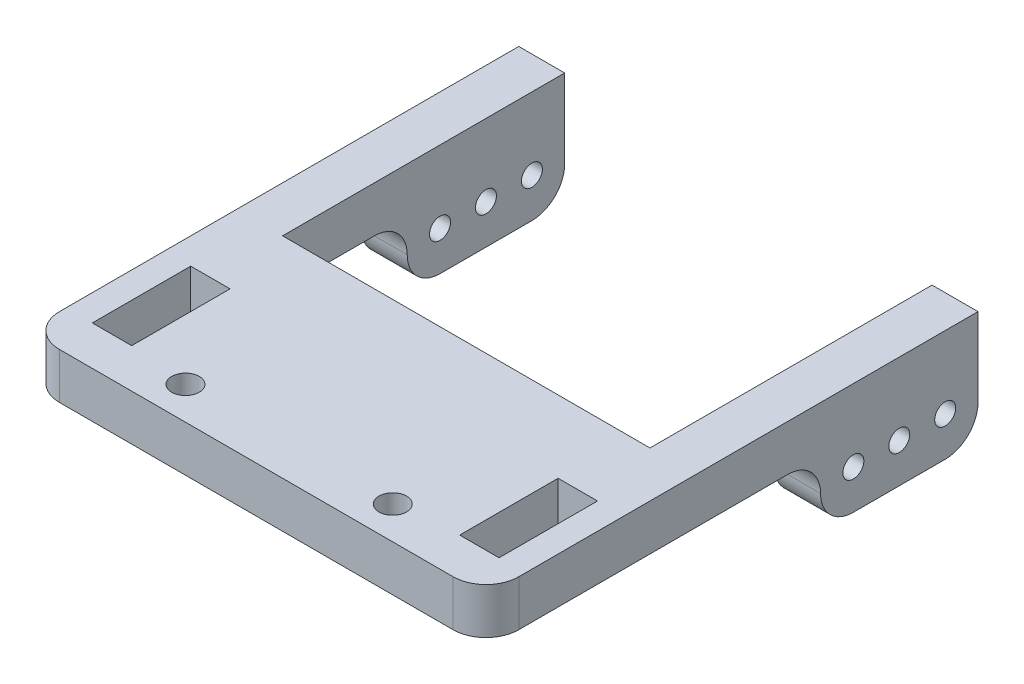
ISO-10303-21;
HEADER;
FILE_DESCRIPTION(('STEP AP214'),'2;1');
FILE_NAME('part.step','',(''),(''),'','','');
FILE_SCHEMA(('AUTOMOTIVE_DESIGN { 1 0 10303 214 1 1 1 1 }'));
ENDSEC;
DATA;
#1=APPLICATION_CONTEXT('core data for automotive mechanical design processes');
#2=APPLICATION_PROTOCOL_DEFINITION('international standard','automotive_design',2000,#1);
#3=PRODUCT_CONTEXT('',#1,'mechanical');
#4=PRODUCT('Part','Part','',(#3));
#5=PRODUCT_RELATED_PRODUCT_CATEGORY('part','',(#4));
#6=PRODUCT_DEFINITION_FORMATION('','',#4);
#7=PRODUCT_DEFINITION_CONTEXT('part definition',#1,'design');
#8=PRODUCT_DEFINITION('design','',#6,#7);
#9=PRODUCT_DEFINITION_SHAPE('','',#8);
#10=(LENGTH_UNIT() NAMED_UNIT(*) SI_UNIT(.MILLI.,.METRE.));
#11=(NAMED_UNIT(*) PLANE_ANGLE_UNIT() SI_UNIT($,.RADIAN.));
#12=(NAMED_UNIT(*) SI_UNIT($,.STERADIAN.) SOLID_ANGLE_UNIT());
#13=UNCERTAINTY_MEASURE_WITH_UNIT(LENGTH_MEASURE(1.E-05),#10,'distance_accuracy_value','');
#14=(GEOMETRIC_REPRESENTATION_CONTEXT(3) GLOBAL_UNCERTAINTY_ASSIGNED_CONTEXT((#13)) GLOBAL_UNIT_ASSIGNED_CONTEXT((#10,
#11,#12)) REPRESENTATION_CONTEXT('',''));
#15=CARTESIAN_POINT('',(0.,0.,0.));
#16=DIRECTION('',(0.,0.,1.));
#17=DIRECTION('',(1.,0.,0.));
#18=AXIS2_PLACEMENT_3D('',#15,#16,#17);
#19=CARTESIAN_POINT('',(0.,0.,0.));
#20=DIRECTION('',(0.,1.,0.));
#21=DIRECTION('',(0.,0.,1.));
#22=AXIS2_PLACEMENT_3D('',#19,#20,#21);
#23=PLANE('',#22);
#24=CARTESIAN_POINT('',(19.2,0.,70.));
#25=DIRECTION('',(0.,1.,0.));
#26=DIRECTION('',(0.,0.,1.));
#27=AXIS2_PLACEMENT_3D('',#24,#25,#26);
#28=CIRCLE('',#27,2.1);
#29=CARTESIAN_POINT('',(19.2,0.,72.1));
#30=VERTEX_POINT('',#29);
#31=EDGE_CURVE('E568',#30,#30,#28,.F.);
#32=ORIENTED_EDGE('',*,*,#31,.F.);
#33=EDGE_LOOP('',(#32));
#34=FACE_BOUND('',#33,.T.);
#35=CARTESIAN_POINT('',(50.8,0.,70.));
#36=DIRECTION('',(0.,1.,0.));
#37=DIRECTION('',(0.,0.,1.));
#38=AXIS2_PLACEMENT_3D('',#35,#36,#37);
#39=CIRCLE('',#38,2.1);
#40=CARTESIAN_POINT('',(50.8,0.,72.1));
#41=VERTEX_POINT('',#40);
#42=EDGE_CURVE('E409',#41,#41,#39,.F.);
#43=ORIENTED_EDGE('',*,*,#42,.F.);
#44=EDGE_LOOP('',(#43));
#45=FACE_BOUND('',#44,.T.);
#46=DIRECTION('',(0.,0.,-1.));
#47=VECTOR('',#46,1.);
#48=CARTESIAN_POINT('',(66.,0.,54.));
#49=LINE('',#48,#47);
#50=CARTESIAN_POINT('',(66.,0.,69.));
#51=VERTEX_POINT('',#50);
#52=CARTESIAN_POINT('',(66.,0.,54.));
#53=VERTEX_POINT('',#52);
#54=EDGE_CURVE('E226',#51,#53,#49,.T.);
#55=ORIENTED_EDGE('',*,*,#54,.T.);
#56=DIRECTION('',(-1.,0.,0.));
#57=VECTOR('',#56,1.);
#58=CARTESIAN_POINT('',(60.,0.,54.));
#59=LINE('',#58,#57);
#60=CARTESIAN_POINT('',(60.,0.,54.));
#61=VERTEX_POINT('',#60);
#62=EDGE_CURVE('E265',#53,#61,#59,.T.);
#63=ORIENTED_EDGE('',*,*,#62,.T.);
#64=DIRECTION('',(0.,0.,1.));
#65=VECTOR('',#64,1.);
#66=CARTESIAN_POINT('',(60.,0.,54.));
#67=LINE('',#66,#65);
#68=CARTESIAN_POINT('',(60.,0.,69.));
#69=VERTEX_POINT('',#68);
#70=EDGE_CURVE('E268',#61,#69,#67,.T.);
#71=ORIENTED_EDGE('',*,*,#70,.T.);
#72=DIRECTION('',(1.,0.,0.));
#73=VECTOR('',#72,1.);
#74=CARTESIAN_POINT('',(60.,0.,69.));
#75=LINE('',#74,#73);
#76=EDGE_CURVE('E255',#69,#51,#75,.T.);
#77=ORIENTED_EDGE('',*,*,#76,.T.);
#78=EDGE_LOOP('',(#55,#63,#71,#77));
#79=FACE_BOUND('',#78,.T.);
#80=DIRECTION('',(0.,0.,-1.));
#81=VECTOR('',#80,1.);
#82=CARTESIAN_POINT('',(10.,0.,54.0000000000002));
#83=LINE('',#82,#81);
#84=CARTESIAN_POINT('',(10.0000000000002,0.,69.0000000000002));
#85=VERTEX_POINT('',#84);
#86=CARTESIAN_POINT('',(10.,0.,54.0000000000002));
#87=VERTEX_POINT('',#86);
#88=EDGE_CURVE('E239',#85,#87,#83,.T.);
#89=ORIENTED_EDGE('',*,*,#88,.T.);
#90=DIRECTION('',(-1.,0.,0.));
#91=VECTOR('',#90,1.);
#92=CARTESIAN_POINT('',(10.,0.,54.0000000000002));
#93=LINE('',#92,#91);
#94=CARTESIAN_POINT('',(4.00000000000007,0.,54.0000000000002));
#95=VERTEX_POINT('',#94);
#96=EDGE_CURVE('E225',#87,#95,#93,.T.);
#97=ORIENTED_EDGE('',*,*,#96,.T.);
#98=DIRECTION('',(0.,0.,1.));
#99=VECTOR('',#98,1.);
#100=CARTESIAN_POINT('',(4.00000000000007,0.,54.0000000000002));
#101=LINE('',#100,#99);
#102=CARTESIAN_POINT('',(4.00000000000018,0.,69.0000000000002));
#103=VERTEX_POINT('',#102);
#104=EDGE_CURVE('E243',#95,#103,#101,.T.);
#105=ORIENTED_EDGE('',*,*,#104,.T.);
#106=DIRECTION('',(1.,0.,0.));
#107=VECTOR('',#106,1.);
#108=CARTESIAN_POINT('',(10.0000000000002,0.,69.0000000000002));
#109=LINE('',#108,#107);
#110=EDGE_CURVE('E219',#103,#85,#109,.T.);
#111=ORIENTED_EDGE('',*,*,#110,.T.);
#112=EDGE_LOOP('',(#89,#97,#105,#111));
#113=FACE_BOUND('',#112,.T.);
#114=DIRECTION('',(0.,0.,-1.));
#115=VECTOR('',#114,1.);
#116=CARTESIAN_POINT('',(70.,0.,0.));
#117=LINE('',#116,#115);
#118=CARTESIAN_POINT('',(70.,0.,70.));
#119=VERTEX_POINT('',#118);
#120=CARTESIAN_POINT('',(70.,0.,29.));
#121=VERTEX_POINT('',#120);
#122=EDGE_CURVE('E308',#119,#121,#117,.T.);
#123=ORIENTED_EDGE('',*,*,#122,.F.);
#124=CARTESIAN_POINT('',(65.,0.,70.));
#125=DIRECTION('',(0.,1.,0.));
#126=DIRECTION('',(0.,0.,1.));
#127=AXIS2_PLACEMENT_3D('',#124,#125,#126);
#128=CIRCLE('',#127,5.);
#129=CARTESIAN_POINT('',(65.,0.,75.));
#130=VERTEX_POINT('',#129);
#131=EDGE_CURVE('E358',#119,#130,#128,.F.);
#132=ORIENTED_EDGE('',*,*,#131,.T.);
#133=DIRECTION('',(1.,0.,0.));
#134=VECTOR('',#133,1.);
#135=CARTESIAN_POINT('',(0.,0.,75.));
#136=LINE('',#135,#134);
#137=CARTESIAN_POINT('',(5.,0.,75.));
#138=VERTEX_POINT('',#137);
#139=EDGE_CURVE('E305',#138,#130,#136,.T.);
#140=ORIENTED_EDGE('',*,*,#139,.F.);
#141=CARTESIAN_POINT('',(5.,0.,70.));
#142=DIRECTION('',(0.,1.,0.));
#143=DIRECTION('',(0.,0.,1.));
#144=AXIS2_PLACEMENT_3D('',#141,#142,#143);
#145=CIRCLE('',#144,5.);
#146=CARTESIAN_POINT('',(0.,0.,70.));
#147=VERTEX_POINT('',#146);
#148=EDGE_CURVE('E356',#138,#147,#145,.F.);
#149=ORIENTED_EDGE('',*,*,#148,.T.);
#150=DIRECTION('',(0.,0.,1.));
#151=VECTOR('',#150,1.);
#152=CARTESIAN_POINT('',(0.,0.,0.));
#153=LINE('',#152,#151);
#154=CARTESIAN_POINT('',(0.,0.,29.));
#155=VERTEX_POINT('',#154);
#156=EDGE_CURVE('E282',#155,#147,#153,.T.);
#157=ORIENTED_EDGE('',*,*,#156,.F.);
#158=DIRECTION('',(-1.,0.,0.));
#159=VECTOR('',#158,1.);
#160=CARTESIAN_POINT('',(7.,0.,29.));
#161=LINE('',#160,#159);
#162=CARTESIAN_POINT('',(7.,0.,29.));
#163=VERTEX_POINT('',#162);
#164=EDGE_CURVE('E352',#155,#163,#161,.F.);
#165=ORIENTED_EDGE('',*,*,#164,.T.);
#166=DIRECTION('',(0.,0.,-1.));
#167=VECTOR('',#166,1.);
#168=CARTESIAN_POINT('',(7.,0.,43.));
#169=LINE('',#168,#167);
#170=CARTESIAN_POINT('',(7.,0.,43.));
#171=VERTEX_POINT('',#170);
#172=EDGE_CURVE('E287',#171,#163,#169,.T.);
#173=ORIENTED_EDGE('',*,*,#172,.F.);
#174=DIRECTION('',(-1.,0.,0.));
#175=VECTOR('',#174,1.);
#176=CARTESIAN_POINT('',(7.,0.,43.));
#177=LINE('',#176,#175);
#178=CARTESIAN_POINT('',(63.,0.,43.));
#179=VERTEX_POINT('',#178);
#180=EDGE_CURVE('E313',#179,#171,#177,.T.);
#181=ORIENTED_EDGE('',*,*,#180,.F.);
#182=DIRECTION('',(0.,0.,1.));
#183=VECTOR('',#182,1.);
#184=CARTESIAN_POINT('',(63.,0.,43.));
#185=LINE('',#184,#183);
#186=CARTESIAN_POINT('',(63.,0.,29.));
#187=VERTEX_POINT('',#186);
#188=EDGE_CURVE('E311',#187,#179,#185,.T.);
#189=ORIENTED_EDGE('',*,*,#188,.F.);
#190=DIRECTION('',(-1.,0.,0.));
#191=VECTOR('',#190,1.);
#192=CARTESIAN_POINT('',(70.,0.,29.));
#193=LINE('',#192,#191);
#194=EDGE_CURVE('E354',#187,#121,#193,.F.);
#195=ORIENTED_EDGE('',*,*,#194,.T.);
#196=EDGE_LOOP('',(#123,#132,#140,#149,#157,#165,#173,#181,#189,#195));
#197=FACE_BOUND('',#196,.T.);
#198=ADVANCED_FACE('F33',(#34,#45,#79,#113,#197),#23,.F.);
#199=CARTESIAN_POINT('',(0.,7.,0.));
#200=DIRECTION('',(0.,1.,0.));
#201=DIRECTION('',(0.,0.,1.));
#202=AXIS2_PLACEMENT_3D('',#199,#200,#201);
#203=PLANE('',#202);
#204=CARTESIAN_POINT('',(19.2,7.,70.));
#205=DIRECTION('',(0.,1.,0.));
#206=DIRECTION('',(0.,0.,1.));
#207=AXIS2_PLACEMENT_3D('',#204,#205,#206);
#208=CIRCLE('',#207,2.1);
#209=CARTESIAN_POINT('',(19.2,7.,72.1));
#210=VERTEX_POINT('',#209);
#211=EDGE_CURVE('E566',#210,#210,#208,.T.);
#212=ORIENTED_EDGE('',*,*,#211,.F.);
#213=EDGE_LOOP('',(#212));
#214=FACE_BOUND('',#213,.T.);
#215=CARTESIAN_POINT('',(50.8,7.,70.));
#216=DIRECTION('',(0.,1.,0.));
#217=DIRECTION('',(0.,0.,-1.));
#218=AXIS2_PLACEMENT_3D('',#215,#216,#217);
#219=CIRCLE('',#218,2.1);
#220=CARTESIAN_POINT('',(50.8,7.,67.9));
#221=VERTEX_POINT('',#220);
#222=EDGE_CURVE('E404',#221,#221,#219,.T.);
#223=ORIENTED_EDGE('',*,*,#222,.F.);
#224=EDGE_LOOP('',(#223));
#225=FACE_BOUND('',#224,.T.);
#226=DIRECTION('',(1.,0.,0.));
#227=VECTOR('',#226,1.);
#228=CARTESIAN_POINT('',(0.,7.,75.));
#229=LINE('',#228,#227);
#230=CARTESIAN_POINT('',(5.,7.,75.));
#231=VERTEX_POINT('',#230);
#232=CARTESIAN_POINT('',(65.,7.,75.));
#233=VERTEX_POINT('',#232);
#234=EDGE_CURVE('E286',#231,#233,#229,.T.);
#235=ORIENTED_EDGE('',*,*,#234,.T.);
#236=CARTESIAN_POINT('',(65.,7.,70.));
#237=DIRECTION('',(0.,1.,0.));
#238=DIRECTION('',(0.,0.,1.));
#239=AXIS2_PLACEMENT_3D('',#236,#237,#238);
#240=CIRCLE('',#239,5.);
#241=CARTESIAN_POINT('',(70.,7.,70.));
#242=VERTEX_POINT('',#241);
#243=EDGE_CURVE('E367',#233,#242,#240,.T.);
#244=ORIENTED_EDGE('',*,*,#243,.T.);
#245=DIRECTION('',(0.,0.,-1.));
#246=VECTOR('',#245,1.);
#247=CARTESIAN_POINT('',(70.,7.,0.));
#248=LINE('',#247,#246);
#249=CARTESIAN_POINT('',(70.,7.,0.));
#250=VERTEX_POINT('',#249);
#251=EDGE_CURVE('E290',#242,#250,#248,.T.);
#252=ORIENTED_EDGE('',*,*,#251,.T.);
#253=DIRECTION('',(-1.,0.,0.));
#254=VECTOR('',#253,1.);
#255=CARTESIAN_POINT('',(63.,7.,0.));
#256=LINE('',#255,#254);
#257=CARTESIAN_POINT('',(63.,7.,0.));
#258=VERTEX_POINT('',#257);
#259=EDGE_CURVE('E292',#250,#258,#256,.T.);
#260=ORIENTED_EDGE('',*,*,#259,.T.);
#261=DIRECTION('',(0.,0.,1.));
#262=VECTOR('',#261,1.);
#263=CARTESIAN_POINT('',(63.,7.,43.));
#264=LINE('',#263,#262);
#265=CARTESIAN_POINT('',(63.,7.,43.));
#266=VERTEX_POINT('',#265);
#267=EDGE_CURVE('E294',#258,#266,#264,.T.);
#268=ORIENTED_EDGE('',*,*,#267,.T.);
#269=DIRECTION('',(-1.,0.,0.));
#270=VECTOR('',#269,1.);
#271=CARTESIAN_POINT('',(7.,7.,43.));
#272=LINE('',#271,#270);
#273=CARTESIAN_POINT('',(7.,7.,43.));
#274=VERTEX_POINT('',#273);
#275=EDGE_CURVE('E296',#266,#274,#272,.T.);
#276=ORIENTED_EDGE('',*,*,#275,.T.);
#277=DIRECTION('',(0.,0.,-1.));
#278=VECTOR('',#277,1.);
#279=CARTESIAN_POINT('',(7.,7.,43.));
#280=LINE('',#279,#278);
#281=CARTESIAN_POINT('',(7.,7.,0.));
#282=VERTEX_POINT('',#281);
#283=EDGE_CURVE('E298',#274,#282,#280,.T.);
#284=ORIENTED_EDGE('',*,*,#283,.T.);
#285=DIRECTION('',(-1.,0.,0.));
#286=VECTOR('',#285,1.);
#287=CARTESIAN_POINT('',(0.,7.,0.));
#288=LINE('',#287,#286);
#289=CARTESIAN_POINT('',(0.,7.,0.));
#290=VERTEX_POINT('',#289);
#291=EDGE_CURVE('E300',#282,#290,#288,.T.);
#292=ORIENTED_EDGE('',*,*,#291,.T.);
#293=DIRECTION('',(0.,0.,1.));
#294=VECTOR('',#293,1.);
#295=CARTESIAN_POINT('',(0.,7.,0.));
#296=LINE('',#295,#294);
#297=CARTESIAN_POINT('',(0.,7.,70.));
#298=VERTEX_POINT('',#297);
#299=EDGE_CURVE('E283',#290,#298,#296,.T.);
#300=ORIENTED_EDGE('',*,*,#299,.T.);
#301=CARTESIAN_POINT('',(5.,7.,70.));
#302=DIRECTION('',(0.,1.,0.));
#303=DIRECTION('',(0.,0.,1.));
#304=AXIS2_PLACEMENT_3D('',#301,#302,#303);
#305=CIRCLE('',#304,5.);
#306=EDGE_CURVE('E365',#298,#231,#305,.T.);
#307=ORIENTED_EDGE('',*,*,#306,.T.);
#308=EDGE_LOOP('',(#235,#244,#252,#260,#268,#276,#284,#292,#300,#307));
#309=FACE_BOUND('',#308,.T.);
#310=DIRECTION('',(-1.,0.,0.));
#311=VECTOR('',#310,1.);
#312=CARTESIAN_POINT('',(60.,7.,54.));
#313=LINE('',#312,#311);
#314=CARTESIAN_POINT('',(66.,7.,54.));
#315=VERTEX_POINT('',#314);
#316=CARTESIAN_POINT('',(60.,7.,54.));
#317=VERTEX_POINT('',#316);
#318=EDGE_CURVE('E254',#315,#317,#313,.T.);
#319=ORIENTED_EDGE('',*,*,#318,.F.);
#320=DIRECTION('',(0.,0.,-1.));
#321=VECTOR('',#320,1.);
#322=CARTESIAN_POINT('',(66.,7.,54.));
#323=LINE('',#322,#321);
#324=CARTESIAN_POINT('',(66.,7.,69.));
#325=VERTEX_POINT('',#324);
#326=EDGE_CURVE('E252',#325,#315,#323,.T.);
#327=ORIENTED_EDGE('',*,*,#326,.F.);
#328=DIRECTION('',(1.,0.,0.));
#329=VECTOR('',#328,1.);
#330=CARTESIAN_POINT('',(60.,7.,69.));
#331=LINE('',#330,#329);
#332=CARTESIAN_POINT('',(60.,7.,69.));
#333=VERTEX_POINT('',#332);
#334=EDGE_CURVE('E260',#333,#325,#331,.T.);
#335=ORIENTED_EDGE('',*,*,#334,.F.);
#336=DIRECTION('',(0.,0.,1.));
#337=VECTOR('',#336,1.);
#338=CARTESIAN_POINT('',(60.,7.,54.));
#339=LINE('',#338,#337);
#340=EDGE_CURVE('E257',#317,#333,#339,.T.);
#341=ORIENTED_EDGE('',*,*,#340,.F.);
#342=EDGE_LOOP('',(#319,#327,#335,#341));
#343=FACE_BOUND('',#342,.T.);
#344=DIRECTION('',(-1.,0.,0.));
#345=VECTOR('',#344,1.);
#346=CARTESIAN_POINT('',(10.,7.,54.0000000000002));
#347=LINE('',#346,#345);
#348=CARTESIAN_POINT('',(10.,7.,54.0000000000002));
#349=VERTEX_POINT('',#348);
#350=CARTESIAN_POINT('',(4.00000000000007,7.,54.0000000000002));
#351=VERTEX_POINT('',#350);
#352=EDGE_CURVE('E218',#349,#351,#347,.T.);
#353=ORIENTED_EDGE('',*,*,#352,.F.);
#354=DIRECTION('',(0.,0.,-1.));
#355=VECTOR('',#354,1.);
#356=CARTESIAN_POINT('',(10.,7.,54.0000000000002));
#357=LINE('',#356,#355);
#358=CARTESIAN_POINT('',(10.0000000000002,7.,69.0000000000002));
#359=VERTEX_POINT('',#358);
#360=EDGE_CURVE('E208',#359,#349,#357,.T.);
#361=ORIENTED_EDGE('',*,*,#360,.F.);
#362=DIRECTION('',(1.,0.,0.));
#363=VECTOR('',#362,1.);
#364=CARTESIAN_POINT('',(10.0000000000002,7.,69.0000000000002));
#365=LINE('',#364,#363);
#366=CARTESIAN_POINT('',(4.00000000000018,7.,69.0000000000002));
#367=VERTEX_POINT('',#366);
#368=EDGE_CURVE('E234',#367,#359,#365,.T.);
#369=ORIENTED_EDGE('',*,*,#368,.F.);
#370=DIRECTION('',(0.,0.,1.));
#371=VECTOR('',#370,1.);
#372=CARTESIAN_POINT('',(4.00000000000007,7.,54.0000000000002));
#373=LINE('',#372,#371);
#374=EDGE_CURVE('E232',#351,#367,#373,.T.);
#375=ORIENTED_EDGE('',*,*,#374,.F.);
#376=EDGE_LOOP('',(#353,#361,#369,#375));
#377=FACE_BOUND('',#376,.T.);
#378=ADVANCED_FACE('F230',(#214,#225,#309,#343,#377),#203,.T.);
#379=CARTESIAN_POINT('',(0.,7.,0.));
#380=DIRECTION('',(1.,0.,0.));
#381=DIRECTION('',(0.,0.,-1.));
#382=AXIS2_PLACEMENT_3D('',#379,#380,#381);
#383=PLANE('',#382);
#384=CARTESIAN_POINT('',(0.,-4.,19.));
#385=DIRECTION('',(1.,0.,0.));
#386=DIRECTION('',(0.,0.,-1.));
#387=AXIS2_PLACEMENT_3D('',#384,#385,#386);
#388=CIRCLE('',#387,1.6);
#389=CARTESIAN_POINT('',(0.,-4.,17.4));
#390=VERTEX_POINT('',#389);
#391=EDGE_CURVE('E337',#390,#390,#388,.T.);
#392=ORIENTED_EDGE('',*,*,#391,.T.);
#393=EDGE_LOOP('',(#392));
#394=FACE_BOUND('',#393,.T.);
#395=CARTESIAN_POINT('',(0.,-4.,5.));
#396=DIRECTION('',(1.,0.,0.));
#397=DIRECTION('',(0.,0.,-1.));
#398=AXIS2_PLACEMENT_3D('',#395,#396,#397);
#399=CIRCLE('',#398,1.6);
#400=CARTESIAN_POINT('',(0.,-4.,3.4));
#401=VERTEX_POINT('',#400);
#402=EDGE_CURVE('E583',#401,#401,#399,.T.);
#403=ORIENTED_EDGE('',*,*,#402,.T.);
#404=EDGE_LOOP('',(#403));
#405=FACE_BOUND('',#404,.T.);
#406=CARTESIAN_POINT('',(0.,-4.,12.));
#407=DIRECTION('',(1.,0.,0.));
#408=DIRECTION('',(0.,0.,-1.));
#409=AXIS2_PLACEMENT_3D('',#406,#407,#408);
#410=CIRCLE('',#409,1.6);
#411=CARTESIAN_POINT('',(0.,-4.,10.4));
#412=VERTEX_POINT('',#411);
#413=EDGE_CURVE('E572',#412,#412,#410,.T.);
#414=ORIENTED_EDGE('',*,*,#413,.T.);
#415=EDGE_LOOP('',(#414));
#416=FACE_BOUND('',#415,.T.);
#417=ORIENTED_EDGE('',*,*,#156,.T.);
#418=DIRECTION('',(0.,-1.,0.));
#419=VECTOR('',#418,1.);
#420=CARTESIAN_POINT('',(0.,7.,70.));
#421=LINE('',#420,#419);
#422=EDGE_CURVE('E373',#147,#298,#421,.F.);
#423=ORIENTED_EDGE('',*,*,#422,.T.);
#424=ORIENTED_EDGE('',*,*,#299,.F.);
#425=DIRECTION('',(0.,-1.,0.));
#426=VECTOR('',#425,1.);
#427=CARTESIAN_POINT('',(0.,7.,0.));
#428=LINE('',#427,#426);
#429=CARTESIAN_POINT('',(0.,-5.,0.));
#430=VERTEX_POINT('',#429);
#431=EDGE_CURVE('E302',#290,#430,#428,.T.);
#432=ORIENTED_EDGE('',*,*,#431,.T.);
#433=CARTESIAN_POINT('',(0.,-5.,5.));
#434=DIRECTION('',(1.,0.,0.));
#435=DIRECTION('',(0.,0.,-1.));
#436=AXIS2_PLACEMENT_3D('',#433,#434,#435);
#437=CIRCLE('',#436,5.);
#438=CARTESIAN_POINT('',(0.,-10.,5.));
#439=VERTEX_POINT('',#438);
#440=EDGE_CURVE('E371',#430,#439,#437,.F.);
#441=ORIENTED_EDGE('',*,*,#440,.T.);
#442=DIRECTION('',(0.,0.,-1.));
#443=VECTOR('',#442,1.);
#444=CARTESIAN_POINT('',(0.,-10.,0.));
#445=LINE('',#444,#443);
#446=CARTESIAN_POINT('',(0.,-10.,19.));
#447=VERTEX_POINT('',#446);
#448=EDGE_CURVE('E462',#447,#439,#445,.T.);
#449=ORIENTED_EDGE('',*,*,#448,.F.);
#450=CARTESIAN_POINT('',(0.,-5.,19.));
#451=DIRECTION('',(1.,0.,0.));
#452=DIRECTION('',(0.,0.,-1.));
#453=AXIS2_PLACEMENT_3D('',#450,#451,#452);
#454=CIRCLE('',#453,5.);
#455=CARTESIAN_POINT('',(0.,-5.,24.));
#456=VERTEX_POINT('',#455);
#457=EDGE_CURVE('E369',#447,#456,#454,.F.);
#458=ORIENTED_EDGE('',*,*,#457,.T.);
#459=CARTESIAN_POINT('',(0.,-5.,29.));
#460=DIRECTION('',(1.,0.,0.));
#461=DIRECTION('',(0.,0.,-1.));
#462=AXIS2_PLACEMENT_3D('',#459,#460,#461);
#463=CIRCLE('',#462,5.);
#464=EDGE_CURVE('E42',#456,#155,#463,.T.);
#465=ORIENTED_EDGE('',*,*,#464,.T.);
#466=EDGE_LOOP('',(#417,#423,#424,#432,#441,#449,#458,#465));
#467=FACE_BOUND('',#466,.T.);
#468=ADVANCED_FACE('F421',(#394,#405,#416,#467),#383,.F.);
#469=CARTESIAN_POINT('',(0.,7.,75.));
#470=DIRECTION('',(0.,0.,-1.));
#471=DIRECTION('',(-1.,0.,0.));
#472=AXIS2_PLACEMENT_3D('',#469,#470,#471);
#473=PLANE('',#472);
#474=ORIENTED_EDGE('',*,*,#139,.T.);
#475=DIRECTION('',(0.,-1.,0.));
#476=VECTOR('',#475,1.);
#477=CARTESIAN_POINT('',(65.,7.,75.));
#478=LINE('',#477,#476);
#479=EDGE_CURVE('E363',#130,#233,#478,.F.);
#480=ORIENTED_EDGE('',*,*,#479,.T.);
#481=ORIENTED_EDGE('',*,*,#234,.F.);
#482=DIRECTION('',(0.,-1.,0.));
#483=VECTOR('',#482,1.);
#484=CARTESIAN_POINT('',(5.,7.,75.));
#485=LINE('',#484,#483);
#486=EDGE_CURVE('E360',#231,#138,#485,.T.);
#487=ORIENTED_EDGE('',*,*,#486,.T.);
#488=EDGE_LOOP('',(#474,#480,#481,#487));
#489=FACE_BOUND('',#488,.T.);
#490=ADVANCED_FACE('F434',(#489),#473,.F.);
#491=CARTESIAN_POINT('',(70.,7.,0.));
#492=DIRECTION('',(-1.,0.,0.));
#493=DIRECTION('',(0.,0.,1.));
#494=AXIS2_PLACEMENT_3D('',#491,#492,#493);
#495=PLANE('',#494);
#496=CARTESIAN_POINT('',(70.,-4.,19.));
#497=DIRECTION('',(1.,0.,0.));
#498=DIRECTION('',(0.,0.,-1.));
#499=AXIS2_PLACEMENT_3D('',#496,#497,#498);
#500=CIRCLE('',#499,1.6);
#501=CARTESIAN_POINT('',(70.,-4.,17.4));
#502=VERTEX_POINT('',#501);
#503=EDGE_CURVE('E580',#502,#502,#500,.T.);
#504=ORIENTED_EDGE('',*,*,#503,.F.);
#505=EDGE_LOOP('',(#504));
#506=FACE_BOUND('',#505,.T.);
#507=CARTESIAN_POINT('',(70.,-4.,5.));
#508=DIRECTION('',(1.,0.,0.));
#509=DIRECTION('',(0.,0.,-1.));
#510=AXIS2_PLACEMENT_3D('',#507,#508,#509);
#511=CIRCLE('',#510,1.6);
#512=CARTESIAN_POINT('',(70.,-4.,3.4));
#513=VERTEX_POINT('',#512);
#514=EDGE_CURVE('E586',#513,#513,#511,.T.);
#515=ORIENTED_EDGE('',*,*,#514,.F.);
#516=EDGE_LOOP('',(#515));
#517=FACE_BOUND('',#516,.T.);
#518=CARTESIAN_POINT('',(70.,-4.,12.));
#519=DIRECTION('',(1.,0.,0.));
#520=DIRECTION('',(0.,0.,-1.));
#521=AXIS2_PLACEMENT_3D('',#518,#519,#520);
#522=CIRCLE('',#521,1.6);
#523=CARTESIAN_POINT('',(70.,-4.,10.4));
#524=VERTEX_POINT('',#523);
#525=EDGE_CURVE('E569',#524,#524,#522,.T.);
#526=ORIENTED_EDGE('',*,*,#525,.F.);
#527=EDGE_LOOP('',(#526));
#528=FACE_BOUND('',#527,.T.);
#529=ORIENTED_EDGE('',*,*,#251,.F.);
#530=DIRECTION('',(0.,-1.,0.));
#531=VECTOR('',#530,1.);
#532=CARTESIAN_POINT('',(70.,7.,70.));
#533=LINE('',#532,#531);
#534=EDGE_CURVE('E349',#242,#119,#533,.T.);
#535=ORIENTED_EDGE('',*,*,#534,.T.);
#536=ORIENTED_EDGE('',*,*,#122,.T.);
#537=CARTESIAN_POINT('',(70.,-5.,29.));
#538=DIRECTION('',(-1.,0.,0.));
#539=DIRECTION('',(0.,0.,1.));
#540=AXIS2_PLACEMENT_3D('',#537,#538,#539);
#541=CIRCLE('',#540,5.);
#542=CARTESIAN_POINT('',(70.,-5.,24.));
#543=VERTEX_POINT('',#542);
#544=EDGE_CURVE('E400',#121,#543,#541,.T.);
#545=ORIENTED_EDGE('',*,*,#544,.T.);
#546=CARTESIAN_POINT('',(70.,-5.,19.));
#547=DIRECTION('',(-1.,0.,0.));
#548=DIRECTION('',(0.,0.,1.));
#549=AXIS2_PLACEMENT_3D('',#546,#547,#548);
#550=CIRCLE('',#549,5.);
#551=CARTESIAN_POINT('',(70.,-10.,19.));
#552=VERTEX_POINT('',#551);
#553=EDGE_CURVE('E347',#543,#552,#550,.F.);
#554=ORIENTED_EDGE('',*,*,#553,.T.);
#555=DIRECTION('',(0.,0.,1.));
#556=VECTOR('',#555,1.);
#557=CARTESIAN_POINT('',(70.,-10.,0.));
#558=LINE('',#557,#556);
#559=CARTESIAN_POINT('',(70.,-10.,5.));
#560=VERTEX_POINT('',#559);
#561=EDGE_CURVE('E455',#560,#552,#558,.T.);
#562=ORIENTED_EDGE('',*,*,#561,.F.);
#563=CARTESIAN_POINT('',(70.,-5.,5.));
#564=DIRECTION('',(-1.,0.,0.));
#565=DIRECTION('',(0.,0.,1.));
#566=AXIS2_PLACEMENT_3D('',#563,#564,#565);
#567=CIRCLE('',#566,5.);
#568=CARTESIAN_POINT('',(70.,-5.,0.));
#569=VERTEX_POINT('',#568);
#570=EDGE_CURVE('E332',#560,#569,#567,.F.);
#571=ORIENTED_EDGE('',*,*,#570,.T.);
#572=DIRECTION('',(0.,-1.,0.));
#573=VECTOR('',#572,1.);
#574=CARTESIAN_POINT('',(70.,7.,0.));
#575=LINE('',#574,#573);
#576=EDGE_CURVE('E329',#250,#569,#575,.T.);
#577=ORIENTED_EDGE('',*,*,#576,.F.);
#578=EDGE_LOOP('',(#529,#535,#536,#545,#554,#562,#571,#577));
#579=FACE_BOUND('',#578,.T.);
#580=ADVANCED_FACE('F444',(#506,#517,#528,#579),#495,.F.);
#581=CARTESIAN_POINT('',(63.,7.,0.));
#582=DIRECTION('',(0.,0.,1.));
#583=DIRECTION('',(1.,0.,0.));
#584=AXIS2_PLACEMENT_3D('',#581,#582,#583);
#585=PLANE('',#584);
#586=ORIENTED_EDGE('',*,*,#576,.T.);
#587=DIRECTION('',(1.,0.,0.));
#588=VECTOR('',#587,1.);
#589=CARTESIAN_POINT('',(63.,-5.,0.));
#590=LINE('',#589,#588);
#591=CARTESIAN_POINT('',(63.,-5.,0.));
#592=VERTEX_POINT('',#591);
#593=EDGE_CURVE('E385',#569,#592,#590,.F.);
#594=ORIENTED_EDGE('',*,*,#593,.T.);
#595=DIRECTION('',(0.,-1.,0.));
#596=VECTOR('',#595,1.);
#597=CARTESIAN_POINT('',(63.,7.,0.));
#598=LINE('',#597,#596);
#599=EDGE_CURVE('E326',#258,#592,#598,.T.);
#600=ORIENTED_EDGE('',*,*,#599,.F.);
#601=ORIENTED_EDGE('',*,*,#259,.F.);
#602=EDGE_LOOP('',(#586,#594,#600,#601));
#603=FACE_BOUND('',#602,.T.);
#604=ADVANCED_FACE('F598',(#603),#585,.F.);
#605=CARTESIAN_POINT('',(63.,7.,43.));
#606=DIRECTION('',(1.,0.,0.));
#607=DIRECTION('',(0.,0.,-1.));
#608=AXIS2_PLACEMENT_3D('',#605,#606,#607);
#609=PLANE('',#608);
#610=CARTESIAN_POINT('',(63.,-4.,19.));
#611=DIRECTION('',(1.,0.,0.));
#612=DIRECTION('',(0.,0.,-1.));
#613=AXIS2_PLACEMENT_3D('',#610,#611,#612);
#614=CIRCLE('',#613,1.6);
#615=CARTESIAN_POINT('',(63.,-4.,17.4));
#616=VERTEX_POINT('',#615);
#617=EDGE_CURVE('E345',#616,#616,#614,.T.);
#618=ORIENTED_EDGE('',*,*,#617,.T.);
#619=EDGE_LOOP('',(#618));
#620=FACE_BOUND('',#619,.T.);
#621=CARTESIAN_POINT('',(63.,-4.,5.));
#622=DIRECTION('',(1.,0.,0.));
#623=DIRECTION('',(0.,0.,-1.));
#624=AXIS2_PLACEMENT_3D('',#621,#622,#623);
#625=CIRCLE('',#624,1.6);
#626=CARTESIAN_POINT('',(63.,-4.,3.4));
#627=VERTEX_POINT('',#626);
#628=EDGE_CURVE('E341',#627,#627,#625,.T.);
#629=ORIENTED_EDGE('',*,*,#628,.T.);
#630=EDGE_LOOP('',(#629));
#631=FACE_BOUND('',#630,.T.);
#632=CARTESIAN_POINT('',(63.,-4.,12.));
#633=DIRECTION('',(1.,0.,0.));
#634=DIRECTION('',(0.,0.,-1.));
#635=AXIS2_PLACEMENT_3D('',#632,#633,#634);
#636=CIRCLE('',#635,1.6);
#637=CARTESIAN_POINT('',(63.,-4.,10.4));
#638=VERTEX_POINT('',#637);
#639=EDGE_CURVE('E336',#638,#638,#636,.T.);
#640=ORIENTED_EDGE('',*,*,#639,.T.);
#641=EDGE_LOOP('',(#640));
#642=FACE_BOUND('',#641,.T.);
#643=DIRECTION('',(0.,0.,-1.));
#644=VECTOR('',#643,1.);
#645=CARTESIAN_POINT('',(63.,-10.,0.));
#646=LINE('',#645,#644);
#647=CARTESIAN_POINT('',(63.,-10.,19.));
#648=VERTEX_POINT('',#647);
#649=CARTESIAN_POINT('',(63.,-10.,5.));
#650=VERTEX_POINT('',#649);
#651=EDGE_CURVE('E463',#648,#650,#646,.T.);
#652=ORIENTED_EDGE('',*,*,#651,.F.);
#653=CARTESIAN_POINT('',(63.,-5.,19.));
#654=DIRECTION('',(1.,0.,0.));
#655=DIRECTION('',(0.,0.,-1.));
#656=AXIS2_PLACEMENT_3D('',#653,#654,#655);
#657=CIRCLE('',#656,5.);
#658=CARTESIAN_POINT('',(63.,-5.,24.));
#659=VERTEX_POINT('',#658);
#660=EDGE_CURVE('E383',#648,#659,#657,.F.);
#661=ORIENTED_EDGE('',*,*,#660,.T.);
#662=CARTESIAN_POINT('',(63.,-5.,29.));
#663=DIRECTION('',(1.,0.,0.));
#664=DIRECTION('',(0.,0.,-1.));
#665=AXIS2_PLACEMENT_3D('',#662,#663,#664);
#666=CIRCLE('',#665,5.);
#667=EDGE_CURVE('E398',#659,#187,#666,.T.);
#668=ORIENTED_EDGE('',*,*,#667,.T.);
#669=ORIENTED_EDGE('',*,*,#188,.T.);
#670=DIRECTION('',(0.,-1.,0.));
#671=VECTOR('',#670,1.);
#672=CARTESIAN_POINT('',(63.,7.,43.));
#673=LINE('',#672,#671);
#674=EDGE_CURVE('E323',#266,#179,#673,.T.);
#675=ORIENTED_EDGE('',*,*,#674,.F.);
#676=ORIENTED_EDGE('',*,*,#267,.F.);
#677=ORIENTED_EDGE('',*,*,#599,.T.);
#678=CARTESIAN_POINT('',(63.,-5.,5.));
#679=DIRECTION('',(1.,0.,0.));
#680=DIRECTION('',(0.,0.,-1.));
#681=AXIS2_PLACEMENT_3D('',#678,#679,#680);
#682=CIRCLE('',#681,5.);
#683=EDGE_CURVE('E381',#592,#650,#682,.F.);
#684=ORIENTED_EDGE('',*,*,#683,.T.);
#685=EDGE_LOOP('',(#652,#661,#668,#669,#675,#676,#677,#684));
#686=FACE_BOUND('',#685,.T.);
#687=ADVANCED_FACE('F467',(#620,#631,#642,#686),#609,.F.);
#688=CARTESIAN_POINT('',(7.,7.,43.));
#689=DIRECTION('',(0.,0.,1.));
#690=DIRECTION('',(1.,0.,0.));
#691=AXIS2_PLACEMENT_3D('',#688,#689,#690);
#692=PLANE('',#691);
#693=ORIENTED_EDGE('',*,*,#180,.T.);
#694=DIRECTION('',(0.,-1.,0.));
#695=VECTOR('',#694,1.);
#696=CARTESIAN_POINT('',(7.,7.,43.));
#697=LINE('',#696,#695);
#698=EDGE_CURVE('E320',#274,#171,#697,.T.);
#699=ORIENTED_EDGE('',*,*,#698,.F.);
#700=ORIENTED_EDGE('',*,*,#275,.F.);
#701=ORIENTED_EDGE('',*,*,#674,.T.);
#702=EDGE_LOOP('',(#693,#699,#700,#701));
#703=FACE_BOUND('',#702,.T.);
#704=ADVANCED_FACE('F482',(#703),#692,.F.);
#705=CARTESIAN_POINT('',(7.,7.,43.));
#706=DIRECTION('',(-1.,0.,0.));
#707=DIRECTION('',(0.,0.,1.));
#708=AXIS2_PLACEMENT_3D('',#705,#706,#707);
#709=PLANE('',#708);
#710=CARTESIAN_POINT('',(7.,-4.,19.));
#711=DIRECTION('',(-1.,0.,0.));
#712=DIRECTION('',(0.,0.,1.));
#713=AXIS2_PLACEMENT_3D('',#710,#711,#712);
#714=CIRCLE('',#713,1.6);
#715=CARTESIAN_POINT('',(7.,-4.,20.6));
#716=VERTEX_POINT('',#715);
#717=EDGE_CURVE('E342',#716,#716,#714,.T.);
#718=ORIENTED_EDGE('',*,*,#717,.T.);
#719=EDGE_LOOP('',(#718));
#720=FACE_BOUND('',#719,.T.);
#721=CARTESIAN_POINT('',(7.,-4.,5.));
#722=DIRECTION('',(-1.,0.,0.));
#723=DIRECTION('',(0.,0.,1.));
#724=AXIS2_PLACEMENT_3D('',#721,#722,#723);
#725=CIRCLE('',#724,1.6);
#726=CARTESIAN_POINT('',(7.,-4.,6.6));
#727=VERTEX_POINT('',#726);
#728=EDGE_CURVE('E338',#727,#727,#725,.T.);
#729=ORIENTED_EDGE('',*,*,#728,.T.);
#730=EDGE_LOOP('',(#729));
#731=FACE_BOUND('',#730,.T.);
#732=CARTESIAN_POINT('',(7.,-4.,12.));
#733=DIRECTION('',(-1.,0.,0.));
#734=DIRECTION('',(0.,0.,1.));
#735=AXIS2_PLACEMENT_3D('',#732,#733,#734);
#736=CIRCLE('',#735,1.6);
#737=CARTESIAN_POINT('',(7.,-4.,13.6));
#738=VERTEX_POINT('',#737);
#739=EDGE_CURVE('E333',#738,#738,#736,.T.);
#740=ORIENTED_EDGE('',*,*,#739,.T.);
#741=EDGE_LOOP('',(#740));
#742=FACE_BOUND('',#741,.T.);
#743=DIRECTION('',(0.,0.,1.));
#744=VECTOR('',#743,1.);
#745=CARTESIAN_POINT('',(7.,-10.,0.));
#746=LINE('',#745,#744);
#747=CARTESIAN_POINT('',(7.,-10.,5.));
#748=VERTEX_POINT('',#747);
#749=CARTESIAN_POINT('',(7.,-10.,19.));
#750=VERTEX_POINT('',#749);
#751=EDGE_CURVE('E241',#748,#750,#746,.T.);
#752=ORIENTED_EDGE('',*,*,#751,.F.);
#753=CARTESIAN_POINT('',(7.,-5.,5.));
#754=DIRECTION('',(-1.,0.,0.));
#755=DIRECTION('',(0.,0.,1.));
#756=AXIS2_PLACEMENT_3D('',#753,#754,#755);
#757=CIRCLE('',#756,5.);
#758=CARTESIAN_POINT('',(7.,-5.,0.));
#759=VERTEX_POINT('',#758);
#760=EDGE_CURVE('E50',#748,#759,#757,.F.);
#761=ORIENTED_EDGE('',*,*,#760,.T.);
#762=DIRECTION('',(0.,-1.,0.));
#763=VECTOR('',#762,1.);
#764=CARTESIAN_POINT('',(7.,7.,0.));
#765=LINE('',#764,#763);
#766=EDGE_CURVE('E318',#282,#759,#765,.T.);
#767=ORIENTED_EDGE('',*,*,#766,.F.);
#768=ORIENTED_EDGE('',*,*,#283,.F.);
#769=ORIENTED_EDGE('',*,*,#698,.T.);
#770=ORIENTED_EDGE('',*,*,#172,.T.);
#771=CARTESIAN_POINT('',(7.,-5.,29.));
#772=DIRECTION('',(-1.,0.,0.));
#773=DIRECTION('',(0.,0.,1.));
#774=AXIS2_PLACEMENT_3D('',#771,#772,#773);
#775=CIRCLE('',#774,5.);
#776=CARTESIAN_POINT('',(7.,-5.,24.));
#777=VERTEX_POINT('',#776);
#778=EDGE_CURVE('E11',#163,#777,#775,.T.);
#779=ORIENTED_EDGE('',*,*,#778,.T.);
#780=CARTESIAN_POINT('',(7.,-5.,19.));
#781=DIRECTION('',(-1.,0.,0.));
#782=DIRECTION('',(0.,0.,1.));
#783=AXIS2_PLACEMENT_3D('',#780,#781,#782);
#784=CIRCLE('',#783,5.);
#785=EDGE_CURVE('E393',#777,#750,#784,.F.);
#786=ORIENTED_EDGE('',*,*,#785,.T.);
#787=EDGE_LOOP('',(#752,#761,#767,#768,#769,#770,#779,#786));
#788=FACE_BOUND('',#787,.T.);
#789=ADVANCED_FACE('F479',(#720,#731,#742,#788),#709,.F.);
#790=CARTESIAN_POINT('',(0.,7.,0.));
#791=DIRECTION('',(0.,0.,1.));
#792=DIRECTION('',(1.,0.,0.));
#793=AXIS2_PLACEMENT_3D('',#790,#791,#792);
#794=PLANE('',#793);
#795=ORIENTED_EDGE('',*,*,#766,.T.);
#796=DIRECTION('',(1.,0.,0.));
#797=VECTOR('',#796,1.);
#798=CARTESIAN_POINT('',(0.,-5.,0.));
#799=LINE('',#798,#797);
#800=EDGE_CURVE('E396',#759,#430,#799,.F.);
#801=ORIENTED_EDGE('',*,*,#800,.T.);
#802=ORIENTED_EDGE('',*,*,#431,.F.);
#803=ORIENTED_EDGE('',*,*,#291,.F.);
#804=EDGE_LOOP('',(#795,#801,#802,#803));
#805=FACE_BOUND('',#804,.T.);
#806=ADVANCED_FACE('F481',(#805),#794,.F.);
#807=CARTESIAN_POINT('',(66.,7.,54.));
#808=DIRECTION('',(-1.,0.,0.));
#809=DIRECTION('',(0.,0.,1.));
#810=AXIS2_PLACEMENT_3D('',#807,#808,#809);
#811=PLANE('',#810);
#812=ORIENTED_EDGE('',*,*,#54,.F.);
#813=DIRECTION('',(0.,-1.,0.));
#814=VECTOR('',#813,1.);
#815=CARTESIAN_POINT('',(66.,7.,69.));
#816=LINE('',#815,#814);
#817=EDGE_CURVE('E262',#325,#51,#816,.T.);
#818=ORIENTED_EDGE('',*,*,#817,.F.);
#819=ORIENTED_EDGE('',*,*,#326,.T.);
#820=DIRECTION('',(0.,-1.,0.));
#821=VECTOR('',#820,1.);
#822=CARTESIAN_POINT('',(66.,7.,54.));
#823=LINE('',#822,#821);
#824=EDGE_CURVE('E279',#315,#53,#823,.T.);
#825=ORIENTED_EDGE('',*,*,#824,.T.);
#826=EDGE_LOOP('',(#812,#818,#819,#825));
#827=FACE_BOUND('',#826,.T.);
#828=ADVANCED_FACE('F489',(#827),#811,.T.);
#829=CARTESIAN_POINT('',(60.,7.,54.));
#830=DIRECTION('',(0.,0.,1.));
#831=DIRECTION('',(1.,0.,0.));
#832=AXIS2_PLACEMENT_3D('',#829,#830,#831);
#833=PLANE('',#832);
#834=ORIENTED_EDGE('',*,*,#62,.F.);
#835=ORIENTED_EDGE('',*,*,#824,.F.);
#836=ORIENTED_EDGE('',*,*,#318,.T.);
#837=DIRECTION('',(0.,-1.,0.));
#838=VECTOR('',#837,1.);
#839=CARTESIAN_POINT('',(60.,7.,54.));
#840=LINE('',#839,#838);
#841=EDGE_CURVE('E277',#317,#61,#840,.T.);
#842=ORIENTED_EDGE('',*,*,#841,.T.);
#843=EDGE_LOOP('',(#834,#835,#836,#842));
#844=FACE_BOUND('',#843,.T.);
#845=ADVANCED_FACE('F508',(#844),#833,.T.);
#846=CARTESIAN_POINT('',(60.,7.,54.));
#847=DIRECTION('',(1.,0.,0.));
#848=DIRECTION('',(0.,0.,-1.));
#849=AXIS2_PLACEMENT_3D('',#846,#847,#848);
#850=PLANE('',#849);
#851=ORIENTED_EDGE('',*,*,#70,.F.);
#852=ORIENTED_EDGE('',*,*,#841,.F.);
#853=ORIENTED_EDGE('',*,*,#340,.T.);
#854=DIRECTION('',(0.,-1.,0.));
#855=VECTOR('',#854,1.);
#856=CARTESIAN_POINT('',(60.,7.,69.));
#857=LINE('',#856,#855);
#858=EDGE_CURVE('E275',#333,#69,#857,.T.);
#859=ORIENTED_EDGE('',*,*,#858,.T.);
#860=EDGE_LOOP('',(#851,#852,#853,#859));
#861=FACE_BOUND('',#860,.T.);
#862=ADVANCED_FACE('F512',(#861),#850,.T.);
#863=CARTESIAN_POINT('',(60.,7.,69.));
#864=DIRECTION('',(0.,0.,-1.));
#865=DIRECTION('',(-1.,0.,0.));
#866=AXIS2_PLACEMENT_3D('',#863,#864,#865);
#867=PLANE('',#866);
#868=ORIENTED_EDGE('',*,*,#76,.F.);
#869=ORIENTED_EDGE('',*,*,#858,.F.);
#870=ORIENTED_EDGE('',*,*,#334,.T.);
#871=ORIENTED_EDGE('',*,*,#817,.T.);
#872=EDGE_LOOP('',(#868,#869,#870,#871));
#873=FACE_BOUND('',#872,.T.);
#874=ADVANCED_FACE('F516',(#873),#867,.T.);
#875=CARTESIAN_POINT('',(10.,7.,54.0000000000002));
#876=DIRECTION('',(-1.,0.,0.));
#877=DIRECTION('',(0.,0.,1.));
#878=AXIS2_PLACEMENT_3D('',#875,#876,#877);
#879=PLANE('',#878);
#880=ORIENTED_EDGE('',*,*,#88,.F.);
#881=DIRECTION('',(0.,-1.,0.));
#882=VECTOR('',#881,1.);
#883=CARTESIAN_POINT('',(10.0000000000002,7.,69.0000000000002));
#884=LINE('',#883,#882);
#885=EDGE_CURVE('E214',#359,#85,#884,.T.);
#886=ORIENTED_EDGE('',*,*,#885,.F.);
#887=ORIENTED_EDGE('',*,*,#360,.T.);
#888=DIRECTION('',(0.,-1.,0.));
#889=VECTOR('',#888,1.);
#890=CARTESIAN_POINT('',(10.,7.,54.0000000000002));
#891=LINE('',#890,#889);
#892=EDGE_CURVE('E211',#349,#87,#891,.T.);
#893=ORIENTED_EDGE('',*,*,#892,.T.);
#894=EDGE_LOOP('',(#880,#886,#887,#893));
#895=FACE_BOUND('',#894,.T.);
#896=ADVANCED_FACE('F210',(#895),#879,.T.);
#897=CARTESIAN_POINT('',(10.,7.,54.0000000000002));
#898=DIRECTION('',(0.,0.,1.));
#899=DIRECTION('',(1.,0.,0.));
#900=AXIS2_PLACEMENT_3D('',#897,#898,#899);
#901=PLANE('',#900);
#902=ORIENTED_EDGE('',*,*,#96,.F.);
#903=ORIENTED_EDGE('',*,*,#892,.F.);
#904=ORIENTED_EDGE('',*,*,#352,.T.);
#905=DIRECTION('',(0.,-1.,0.));
#906=VECTOR('',#905,1.);
#907=CARTESIAN_POINT('',(4.00000000000007,7.,54.0000000000002));
#908=LINE('',#907,#906);
#909=EDGE_CURVE('E227',#351,#95,#908,.T.);
#910=ORIENTED_EDGE('',*,*,#909,.T.);
#911=EDGE_LOOP('',(#902,#903,#904,#910));
#912=FACE_BOUND('',#911,.T.);
#913=ADVANCED_FACE('F222',(#912),#901,.T.);
#914=CARTESIAN_POINT('',(4.00000000000007,7.,54.0000000000002));
#915=DIRECTION('',(1.,0.,0.));
#916=DIRECTION('',(0.,0.,-1.));
#917=AXIS2_PLACEMENT_3D('',#914,#915,#916);
#918=PLANE('',#917);
#919=ORIENTED_EDGE('',*,*,#104,.F.);
#920=ORIENTED_EDGE('',*,*,#909,.F.);
#921=ORIENTED_EDGE('',*,*,#374,.T.);
#922=DIRECTION('',(0.,-1.,0.));
#923=VECTOR('',#922,1.);
#924=CARTESIAN_POINT('',(4.00000000000018,7.,69.0000000000002));
#925=LINE('',#924,#923);
#926=EDGE_CURVE('E249',#367,#103,#925,.T.);
#927=ORIENTED_EDGE('',*,*,#926,.T.);
#928=EDGE_LOOP('',(#919,#920,#921,#927));
#929=FACE_BOUND('',#928,.T.);
#930=ADVANCED_FACE('F525',(#929),#918,.T.);
#931=CARTESIAN_POINT('',(10.0000000000002,7.,69.0000000000002));
#932=DIRECTION('',(0.,0.,-1.));
#933=DIRECTION('',(-1.,0.,0.));
#934=AXIS2_PLACEMENT_3D('',#931,#932,#933);
#935=PLANE('',#934);
#936=ORIENTED_EDGE('',*,*,#110,.F.);
#937=ORIENTED_EDGE('',*,*,#926,.F.);
#938=ORIENTED_EDGE('',*,*,#368,.T.);
#939=ORIENTED_EDGE('',*,*,#885,.T.);
#940=EDGE_LOOP('',(#936,#937,#938,#939));
#941=FACE_BOUND('',#940,.T.);
#942=ADVANCED_FACE('F528',(#941),#935,.T.);
#943=CARTESIAN_POINT('',(0.,-10.,0.));
#944=DIRECTION('',(0.,1.,0.));
#945=DIRECTION('',(0.,0.,1.));
#946=AXIS2_PLACEMENT_3D('',#943,#944,#945);
#947=PLANE('',#946);
#948=ORIENTED_EDGE('',*,*,#448,.T.);
#949=DIRECTION('',(1.,0.,0.));
#950=VECTOR('',#949,1.);
#951=CARTESIAN_POINT('',(0.,-10.,5.));
#952=LINE('',#951,#950);
#953=EDGE_CURVE('E390',#439,#748,#952,.T.);
#954=ORIENTED_EDGE('',*,*,#953,.T.);
#955=ORIENTED_EDGE('',*,*,#751,.T.);
#956=DIRECTION('',(-1.,0.,0.));
#957=VECTOR('',#956,1.);
#958=CARTESIAN_POINT('',(0.,-10.,19.));
#959=LINE('',#958,#957);
#960=EDGE_CURVE('E387',#750,#447,#959,.T.);
#961=ORIENTED_EDGE('',*,*,#960,.T.);
#962=EDGE_LOOP('',(#948,#954,#955,#961));
#963=FACE_BOUND('',#962,.T.);
#964=ADVANCED_FACE('F477',(#963),#947,.F.);
#965=CARTESIAN_POINT('',(0.,-10.,0.));
#966=DIRECTION('',(0.,1.,0.));
#967=DIRECTION('',(0.,0.,1.));
#968=AXIS2_PLACEMENT_3D('',#965,#966,#967);
#969=PLANE('',#968);
#970=ORIENTED_EDGE('',*,*,#561,.T.);
#971=DIRECTION('',(-1.,0.,0.));
#972=VECTOR('',#971,1.);
#973=CARTESIAN_POINT('',(0.,-10.,19.));
#974=LINE('',#973,#972);
#975=EDGE_CURVE('E378',#552,#648,#974,.T.);
#976=ORIENTED_EDGE('',*,*,#975,.T.);
#977=ORIENTED_EDGE('',*,*,#651,.T.);
#978=DIRECTION('',(1.,0.,0.));
#979=VECTOR('',#978,1.);
#980=CARTESIAN_POINT('',(0.,-10.,5.));
#981=LINE('',#980,#979);
#982=EDGE_CURVE('E375',#650,#560,#981,.T.);
#983=ORIENTED_EDGE('',*,*,#982,.T.);
#984=EDGE_LOOP('',(#970,#976,#977,#983));
#985=FACE_BOUND('',#984,.T.);
#986=ADVANCED_FACE('F458',(#985),#969,.F.);
#987=CARTESIAN_POINT('',(0.,-4.,12.));
#988=DIRECTION('',(1.,0.,0.));
#989=DIRECTION('',(0.,0.,-1.));
#990=AXIS2_PLACEMENT_3D('',#987,#988,#989);
#991=CYLINDRICAL_SURFACE('',#990,1.6);
#992=ORIENTED_EDGE('',*,*,#413,.F.);
#993=EDGE_LOOP('',(#992));
#994=FACE_BOUND('',#993,.T.);
#995=ORIENTED_EDGE('',*,*,#739,.F.);
#996=EDGE_LOOP('',(#995));
#997=FACE_BOUND('',#996,.T.);
#998=ADVANCED_FACE('F537',(#994,#997),#991,.F.);
#999=CARTESIAN_POINT('',(0.,-4.,5.));
#1000=DIRECTION('',(1.,0.,0.));
#1001=DIRECTION('',(0.,0.,-1.));
#1002=AXIS2_PLACEMENT_3D('',#999,#1000,#1001);
#1003=CYLINDRICAL_SURFACE('',#1002,1.6);
#1004=ORIENTED_EDGE('',*,*,#402,.F.);
#1005=EDGE_LOOP('',(#1004));
#1006=FACE_BOUND('',#1005,.T.);
#1007=ORIENTED_EDGE('',*,*,#728,.F.);
#1008=EDGE_LOOP('',(#1007));
#1009=FACE_BOUND('',#1008,.T.);
#1010=ADVANCED_FACE('F548',(#1006,#1009),#1003,.F.);
#1011=CARTESIAN_POINT('',(0.,-4.,19.));
#1012=DIRECTION('',(1.,0.,0.));
#1013=DIRECTION('',(0.,0.,-1.));
#1014=AXIS2_PLACEMENT_3D('',#1011,#1012,#1013);
#1015=CYLINDRICAL_SURFACE('',#1014,1.6);
#1016=ORIENTED_EDGE('',*,*,#391,.F.);
#1017=EDGE_LOOP('',(#1016));
#1018=FACE_BOUND('',#1017,.T.);
#1019=ORIENTED_EDGE('',*,*,#717,.F.);
#1020=EDGE_LOOP('',(#1019));
#1021=FACE_BOUND('',#1020,.T.);
#1022=ADVANCED_FACE('F542',(#1018,#1021),#1015,.F.);
#1023=ORIENTED_EDGE('',*,*,#525,.T.);
#1024=EDGE_LOOP('',(#1023));
#1025=FACE_BOUND('',#1024,.T.);
#1026=ORIENTED_EDGE('',*,*,#639,.F.);
#1027=EDGE_LOOP('',(#1026));
#1028=FACE_BOUND('',#1027,.T.);
#1029=ADVANCED_FACE('F538',(#1025,#1028),#991,.F.);
#1030=ORIENTED_EDGE('',*,*,#514,.T.);
#1031=EDGE_LOOP('',(#1030));
#1032=FACE_BOUND('',#1031,.T.);
#1033=ORIENTED_EDGE('',*,*,#628,.F.);
#1034=EDGE_LOOP('',(#1033));
#1035=FACE_BOUND('',#1034,.T.);
#1036=ADVANCED_FACE('F541',(#1032,#1035),#1003,.F.);
#1037=ORIENTED_EDGE('',*,*,#503,.T.);
#1038=EDGE_LOOP('',(#1037));
#1039=FACE_BOUND('',#1038,.T.);
#1040=ORIENTED_EDGE('',*,*,#617,.F.);
#1041=EDGE_LOOP('',(#1040));
#1042=FACE_BOUND('',#1041,.T.);
#1043=ADVANCED_FACE('F546',(#1039,#1042),#1015,.F.);
#1044=CARTESIAN_POINT('',(50.8,-10.001,70.));
#1045=DIRECTION('',(0.,1.,0.));
#1046=DIRECTION('',(0.,0.,1.));
#1047=AXIS2_PLACEMENT_3D('',#1044,#1045,#1046);
#1048=CYLINDRICAL_SURFACE('',#1047,2.1);
#1049=ORIENTED_EDGE('',*,*,#222,.T.);
#1050=EDGE_LOOP('',(#1049));
#1051=FACE_BOUND('',#1050,.T.);
#1052=ORIENTED_EDGE('',*,*,#42,.T.);
#1053=EDGE_LOOP('',(#1052));
#1054=FACE_BOUND('',#1053,.T.);
#1055=ADVANCED_FACE('F551',(#1051,#1054),#1048,.F.);
#1056=CARTESIAN_POINT('',(19.2,-10.001,70.));
#1057=DIRECTION('',(0.,1.,0.));
#1058=DIRECTION('',(0.,0.,1.));
#1059=AXIS2_PLACEMENT_3D('',#1056,#1057,#1058);
#1060=CYLINDRICAL_SURFACE('',#1059,2.1);
#1061=ORIENTED_EDGE('',*,*,#211,.T.);
#1062=EDGE_LOOP('',(#1061));
#1063=FACE_BOUND('',#1062,.T.);
#1064=ORIENTED_EDGE('',*,*,#31,.T.);
#1065=EDGE_LOOP('',(#1064));
#1066=FACE_BOUND('',#1065,.T.);
#1067=ADVANCED_FACE('F555',(#1063,#1066),#1060,.F.);
#1068=CARTESIAN_POINT('',(65.,7.,70.));
#1069=DIRECTION('',(0.,-1.,0.));
#1070=DIRECTION('',(0.,0.,-1.));
#1071=AXIS2_PLACEMENT_3D('',#1068,#1069,#1070);
#1072=CYLINDRICAL_SURFACE('',#1071,5.);
#1073=ORIENTED_EDGE('',*,*,#243,.F.);
#1074=ORIENTED_EDGE('',*,*,#479,.F.);
#1075=ORIENTED_EDGE('',*,*,#131,.F.);
#1076=ORIENTED_EDGE('',*,*,#534,.F.);
#1077=EDGE_LOOP('',(#1073,#1074,#1075,#1076));
#1078=FACE_BOUND('',#1077,.T.);
#1079=ADVANCED_FACE('F442',(#1078),#1072,.T.);
#1080=CARTESIAN_POINT('',(5.,7.,70.));
#1081=DIRECTION('',(0.,-1.,0.));
#1082=DIRECTION('',(0.,0.,-1.));
#1083=AXIS2_PLACEMENT_3D('',#1080,#1081,#1082);
#1084=CYLINDRICAL_SURFACE('',#1083,5.);
#1085=ORIENTED_EDGE('',*,*,#306,.F.);
#1086=ORIENTED_EDGE('',*,*,#422,.F.);
#1087=ORIENTED_EDGE('',*,*,#148,.F.);
#1088=ORIENTED_EDGE('',*,*,#486,.F.);
#1089=EDGE_LOOP('',(#1085,#1086,#1087,#1088));
#1090=FACE_BOUND('',#1089,.T.);
#1091=ADVANCED_FACE('F431',(#1090),#1084,.T.);
#1092=CARTESIAN_POINT('',(63.,-5.,29.));
#1093=DIRECTION('',(1.,0.,0.));
#1094=DIRECTION('',(0.,0.,-1.));
#1095=AXIS2_PLACEMENT_3D('',#1092,#1093,#1094);
#1096=CYLINDRICAL_SURFACE('',#1095,5.);
#1097=DIRECTION('',(-1.,0.,0.));
#1098=VECTOR('',#1097,1.);
#1099=CARTESIAN_POINT('',(63.,-5.,24.));
#1100=LINE('',#1099,#1098);
#1101=EDGE_CURVE('E402',#543,#659,#1100,.T.);
#1102=ORIENTED_EDGE('',*,*,#1101,.F.);
#1103=ORIENTED_EDGE('',*,*,#544,.F.);
#1104=ORIENTED_EDGE('',*,*,#194,.F.);
#1105=ORIENTED_EDGE('',*,*,#667,.F.);
#1106=EDGE_LOOP('',(#1102,#1103,#1104,#1105));
#1107=FACE_BOUND('',#1106,.T.);
#1108=ADVANCED_FACE('F452',(#1107),#1096,.F.);
#1109=CARTESIAN_POINT('',(0.,-5.,19.));
#1110=DIRECTION('',(-1.,0.,0.));
#1111=DIRECTION('',(0.,0.,1.));
#1112=AXIS2_PLACEMENT_3D('',#1109,#1110,#1111);
#1113=CYLINDRICAL_SURFACE('',#1112,5.);
#1114=ORIENTED_EDGE('',*,*,#553,.F.);
#1115=ORIENTED_EDGE('',*,*,#1101,.T.);
#1116=ORIENTED_EDGE('',*,*,#660,.F.);
#1117=ORIENTED_EDGE('',*,*,#975,.F.);
#1118=EDGE_LOOP('',(#1114,#1115,#1116,#1117));
#1119=FACE_BOUND('',#1118,.T.);
#1120=ADVANCED_FACE('F465',(#1119),#1113,.T.);
#1121=CARTESIAN_POINT('',(0.,-5.,5.));
#1122=DIRECTION('',(1.,0.,0.));
#1123=DIRECTION('',(0.,0.,-1.));
#1124=AXIS2_PLACEMENT_3D('',#1121,#1122,#1123);
#1125=CYLINDRICAL_SURFACE('',#1124,5.);
#1126=ORIENTED_EDGE('',*,*,#683,.F.);
#1127=ORIENTED_EDGE('',*,*,#593,.F.);
#1128=ORIENTED_EDGE('',*,*,#570,.F.);
#1129=ORIENTED_EDGE('',*,*,#982,.F.);
#1130=EDGE_LOOP('',(#1126,#1127,#1128,#1129));
#1131=FACE_BOUND('',#1130,.T.);
#1132=ADVANCED_FACE('F621',(#1131),#1125,.T.);
#1133=CARTESIAN_POINT('',(0.,-5.,5.));
#1134=DIRECTION('',(1.,0.,0.));
#1135=DIRECTION('',(0.,0.,-1.));
#1136=AXIS2_PLACEMENT_3D('',#1133,#1134,#1135);
#1137=CYLINDRICAL_SURFACE('',#1136,5.);
#1138=ORIENTED_EDGE('',*,*,#440,.F.);
#1139=ORIENTED_EDGE('',*,*,#800,.F.);
#1140=ORIENTED_EDGE('',*,*,#760,.F.);
#1141=ORIENTED_EDGE('',*,*,#953,.F.);
#1142=EDGE_LOOP('',(#1138,#1139,#1140,#1141));
#1143=FACE_BOUND('',#1142,.T.);
#1144=ADVANCED_FACE('F626',(#1143),#1137,.T.);
#1145=CARTESIAN_POINT('',(0.,-5.,29.));
#1146=DIRECTION('',(1.,0.,0.));
#1147=DIRECTION('',(0.,0.,-1.));
#1148=AXIS2_PLACEMENT_3D('',#1145,#1146,#1147);
#1149=CYLINDRICAL_SURFACE('',#1148,5.);
#1150=DIRECTION('',(-1.,0.,0.));
#1151=VECTOR('',#1150,1.);
#1152=CARTESIAN_POINT('',(0.,-5.,24.));
#1153=LINE('',#1152,#1151);
#1154=EDGE_CURVE('E37',#777,#456,#1153,.T.);
#1155=ORIENTED_EDGE('',*,*,#1154,.F.);
#1156=ORIENTED_EDGE('',*,*,#778,.F.);
#1157=ORIENTED_EDGE('',*,*,#164,.F.);
#1158=ORIENTED_EDGE('',*,*,#464,.F.);
#1159=EDGE_LOOP('',(#1155,#1156,#1157,#1158));
#1160=FACE_BOUND('',#1159,.T.);
#1161=ADVANCED_FACE('F35',(#1160),#1149,.F.);
#1162=CARTESIAN_POINT('',(0.,-5.,19.));
#1163=DIRECTION('',(-1.,0.,0.));
#1164=DIRECTION('',(0.,0.,1.));
#1165=AXIS2_PLACEMENT_3D('',#1162,#1163,#1164);
#1166=CYLINDRICAL_SURFACE('',#1165,5.);
#1167=ORIENTED_EDGE('',*,*,#785,.F.);
#1168=ORIENTED_EDGE('',*,*,#1154,.T.);
#1169=ORIENTED_EDGE('',*,*,#457,.F.);
#1170=ORIENTED_EDGE('',*,*,#960,.F.);
#1171=EDGE_LOOP('',(#1167,#1168,#1169,#1170));
#1172=FACE_BOUND('',#1171,.T.);
#1173=ADVANCED_FACE('F414',(#1172),#1166,.T.);
#1174=CLOSED_SHELL('',(#198,#378,#468,#490,#580,#604,#687,#704,#789,#806,#828,#845,#862,#874,
#896,#913,#930,#942,#964,#986,#998,#1010,#1022,#1029,#1036,#1043,#1055,#1067,#1079,#1091,#1108,
#1120,#1132,#1144,#1161,#1173));
#1175=MANIFOLD_SOLID_BREP('B2',#1174);
#1176=ADVANCED_BREP_SHAPE_REPRESENTATION('',(#18,#1175),#14);
#1177=SHAPE_DEFINITION_REPRESENTATION(#9,#1176);
ENDSEC;
END-ISO-10303-21;
